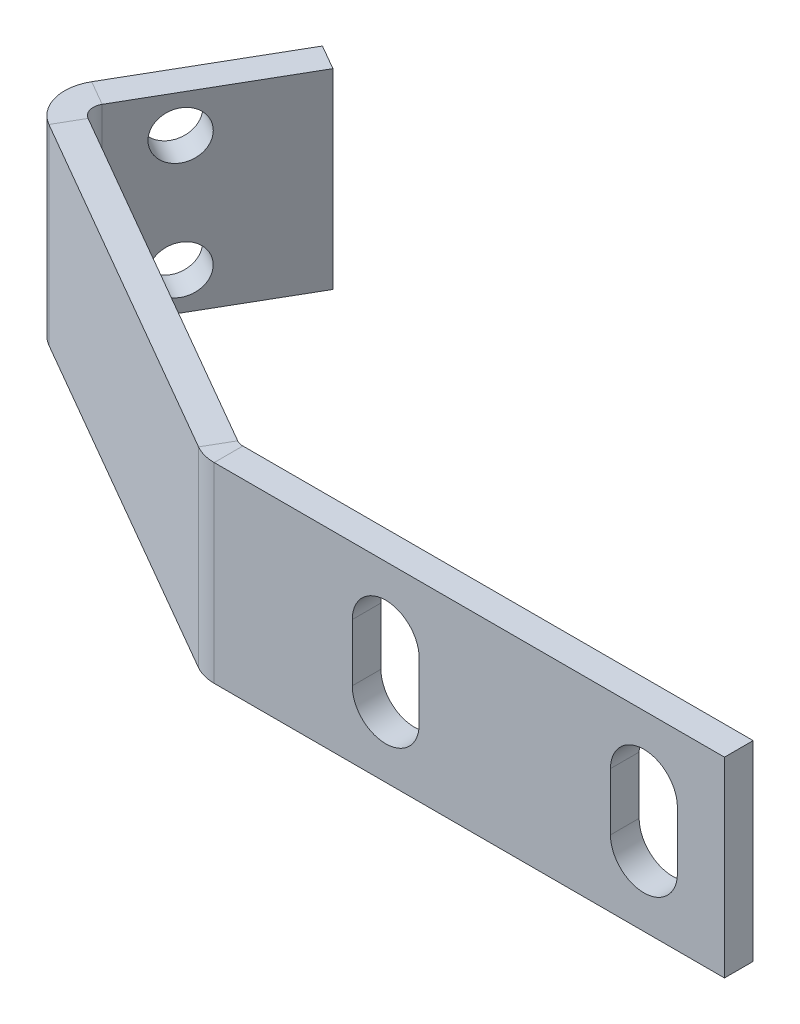
ISO-10303-21;
HEADER;
FILE_DESCRIPTION(('STEP AP214'),'2;1');
FILE_NAME('part.step','',(''),(''),'','','');
FILE_SCHEMA(('AUTOMOTIVE_DESIGN { 1 0 10303 214 1 1 1 1 }'));
ENDSEC;
DATA;
#1=APPLICATION_CONTEXT('core data for automotive mechanical design processes');
#2=APPLICATION_PROTOCOL_DEFINITION('international standard','automotive_design',2000,#1);
#3=PRODUCT_CONTEXT('',#1,'mechanical');
#4=PRODUCT('Part','Part','',(#3));
#5=PRODUCT_RELATED_PRODUCT_CATEGORY('part','',(#4));
#6=PRODUCT_DEFINITION_FORMATION('','',#4);
#7=PRODUCT_DEFINITION_CONTEXT('part definition',#1,'design');
#8=PRODUCT_DEFINITION('design','',#6,#7);
#9=PRODUCT_DEFINITION_SHAPE('','',#8);
#10=(LENGTH_UNIT() NAMED_UNIT(*) SI_UNIT(.MILLI.,.METRE.));
#11=(NAMED_UNIT(*) PLANE_ANGLE_UNIT() SI_UNIT($,.RADIAN.));
#12=(NAMED_UNIT(*) SI_UNIT($,.STERADIAN.) SOLID_ANGLE_UNIT());
#13=UNCERTAINTY_MEASURE_WITH_UNIT(LENGTH_MEASURE(1.E-05),#10,'distance_accuracy_value','');
#14=(GEOMETRIC_REPRESENTATION_CONTEXT(3) GLOBAL_UNCERTAINTY_ASSIGNED_CONTEXT((#13)) GLOBAL_UNIT_ASSIGNED_CONTEXT((#10,
#11,#12)) REPRESENTATION_CONTEXT('',''));
#15=CARTESIAN_POINT('',(0.,0.,0.));
#16=DIRECTION('',(0.,0.,1.));
#17=DIRECTION('',(1.,0.,0.));
#18=AXIS2_PLACEMENT_3D('',#15,#16,#17);
#19=CARTESIAN_POINT('',(0.750616148857739,0.,-2.8695766574746));
#20=DIRECTION('',(0.500000000000001,0.,-0.866025403784438));
#21=DIRECTION('',(-0.866025403784438,0.,-0.500000000000001));
#22=AXIS2_PLACEMENT_3D('',#19,#20,#21);
#23=PLANE('',#22);
#24=DIRECTION('',(-0.866025403784438,0.,-0.500000000000001));
#25=VECTOR('',#24,1.);
#26=CARTESIAN_POINT('',(-25.2301459646754,5.,-17.8695766574746));
#27=LINE('',#26,#25);
#28=CARTESIAN_POINT('',(2.95186387960887,5.,-1.59868568757238));
#29=VERTEX_POINT('',#28);
#30=CARTESIAN_POINT('',(-15.5587441262545,5.,-12.2857902026213));
#31=VERTEX_POINT('',#30);
#32=EDGE_CURVE('E322',#29,#31,#27,.T.);
#33=ORIENTED_EDGE('',*,*,#32,.F.);
#34=DIRECTION('',(0.,-1.,0.));
#35=VECTOR('',#34,1.);
#36=CARTESIAN_POINT('',(2.95186387960887,0.,-1.59868568757238));
#37=LINE('',#36,#35);
#38=CARTESIAN_POINT('',(2.95186387960886,-5.,-1.59868568757238));
#39=VERTEX_POINT('',#38);
#40=EDGE_CURVE('E355',#29,#39,#37,.T.);
#41=ORIENTED_EDGE('',*,*,#40,.T.);
#42=DIRECTION('',(0.866025403784438,0.,0.500000000000001));
#43=VECTOR('',#42,1.);
#44=CARTESIAN_POINT('',(-25.2301459646754,-5.,-17.8695766574746));
#45=LINE('',#44,#43);
#46=CARTESIAN_POINT('',(-15.5587441262545,-5.,-12.2857902026213));
#47=VERTEX_POINT('',#46);
#48=EDGE_CURVE('E316',#47,#39,#45,.T.);
#49=ORIENTED_EDGE('',*,*,#48,.F.);
#50=DIRECTION('',(0.,1.,0.));
#51=VECTOR('',#50,1.);
#52=CARTESIAN_POINT('',(-15.5587441262545,0.,-12.2857902026213));
#53=LINE('',#52,#51);
#54=EDGE_CURVE('E323',#47,#31,#53,.T.);
#55=ORIENTED_EDGE('',*,*,#54,.T.);
#56=EDGE_LOOP('',(#33,#41,#49,#55));
#57=FACE_BOUND('',#56,.T.);
#58=ADVANCED_FACE('F62',(#57),#23,.T.);
#59=CARTESIAN_POINT('',(-25.2301459646754,5.,-17.8695766574746));
#60=DIRECTION('',(0.,1.,0.));
#61=DIRECTION('',(-0.500000000000001,0.,0.866025403784438));
#62=AXIS2_PLACEMENT_3D('',#59,#60,#61);
#63=PLANE('',#62);
#64=DIRECTION('',(-0.866025403784438,0.,-0.500000000000001));
#65=VECTOR('',#64,1.);
#66=CARTESIAN_POINT('',(-25.9801459646754,5.,-16.570538551798));
#67=LINE('',#66,#65);
#68=CARTESIAN_POINT('',(2.20186387960886,5.,-0.299647581895727));
#69=VERTEX_POINT('',#68);
#70=CARTESIAN_POINT('',(-16.3087441262545,5.,-10.9867520969446));
#71=VERTEX_POINT('',#70);
#72=EDGE_CURVE('E317',#69,#71,#67,.T.);
#73=ORIENTED_EDGE('',*,*,#72,.F.);
#74=DIRECTION('',(0.500000000000001,0.,-0.866025403784438));
#75=VECTOR('',#74,1.);
#76=CARTESIAN_POINT('',(2.95186387960886,5.,-1.59868568757238));
#77=LINE('',#76,#75);
#78=EDGE_CURVE('E363',#69,#29,#77,.T.);
#79=ORIENTED_EDGE('',*,*,#78,.T.);
#80=ORIENTED_EDGE('',*,*,#32,.T.);
#81=DIRECTION('',(-0.500000000000001,0.,0.866025403784438));
#82=VECTOR('',#81,1.);
#83=CARTESIAN_POINT('',(-15.5587441262545,5.,-12.2857902026213));
#84=LINE('',#83,#82);
#85=EDGE_CURVE('E318',#31,#71,#84,.T.);
#86=ORIENTED_EDGE('',*,*,#85,.T.);
#87=EDGE_LOOP('',(#73,#79,#80,#86));
#88=FACE_BOUND('',#87,.T.);
#89=ADVANCED_FACE('F417',(#88),#63,.T.);
#90=CARTESIAN_POINT('',(-25.2301459646754,-5.,-17.8695766574746));
#91=DIRECTION('',(0.,-1.,0.));
#92=DIRECTION('',(0.500000000000001,0.,-0.866025403784438));
#93=AXIS2_PLACEMENT_3D('',#90,#91,#92);
#94=PLANE('',#93);
#95=ORIENTED_EDGE('',*,*,#48,.T.);
#96=DIRECTION('',(-0.500000000000001,0.,0.866025403784438));
#97=VECTOR('',#96,1.);
#98=CARTESIAN_POINT('',(2.95186387960886,-5.,-1.59868568757238));
#99=LINE('',#98,#97);
#100=CARTESIAN_POINT('',(2.20186387960886,-5.,-0.299647581895727));
#101=VERTEX_POINT('',#100);
#102=EDGE_CURVE('E368',#39,#101,#99,.T.);
#103=ORIENTED_EDGE('',*,*,#102,.T.);
#104=DIRECTION('',(0.866025403784438,0.,0.500000000000001));
#105=VECTOR('',#104,1.);
#106=CARTESIAN_POINT('',(-25.9801459646754,-5.,-16.570538551798));
#107=LINE('',#106,#105);
#108=CARTESIAN_POINT('',(-16.3087441262545,-5.,-10.9867520969446));
#109=VERTEX_POINT('',#108);
#110=EDGE_CURVE('E321',#109,#101,#107,.T.);
#111=ORIENTED_EDGE('',*,*,#110,.F.);
#112=DIRECTION('',(0.500000000000001,0.,-0.866025403784438));
#113=VECTOR('',#112,1.);
#114=CARTESIAN_POINT('',(-15.5587441262545,-5.,-12.2857902026213));
#115=LINE('',#114,#113);
#116=EDGE_CURVE('E313',#109,#47,#115,.T.);
#117=ORIENTED_EDGE('',*,*,#116,.T.);
#118=EDGE_LOOP('',(#95,#103,#111,#117));
#119=FACE_BOUND('',#118,.T.);
#120=ADVANCED_FACE('F64',(#119),#94,.T.);
#121=CARTESIAN_POINT('',(-27.7111829992122,0.,4.28965136121627));
#122=DIRECTION('',(0.866025403784436,0.,0.500000000000004));
#123=DIRECTION('',(0.500000000000004,0.,-0.866025403784436));
#124=AXIS2_PLACEMENT_3D('',#121,#122,#123);
#125=PLANE('',#124);
#126=CARTESIAN_POINT('',(-15.6273965443588,-3.04204544847123,-16.6400807264022));
#127=DIRECTION('',(-0.866025403784436,0.,-0.500000000000004));
#128=DIRECTION('',(-0.500000000000004,0.,0.866025403784436));
#129=AXIS2_PLACEMENT_3D('',#126,#127,#128);
#130=CIRCLE('',#129,1.25);
#131=CARTESIAN_POINT('',(-16.2523965443588,-3.04204544847123,-15.5575489716716));
#132=VERTEX_POINT('',#131);
#133=EDGE_CURVE('E251',#132,#132,#130,.T.);
#134=ORIENTED_EDGE('',*,*,#133,.F.);
#135=EDGE_LOOP('',(#134));
#136=FACE_BOUND('',#135,.T.);
#137=CARTESIAN_POINT('',(-15.6260131484009,3.04204544847139,-16.6424768384883));
#138=DIRECTION('',(-0.866025403784436,0.,-0.500000000000004));
#139=DIRECTION('',(-0.500000000000004,0.,0.866025403784436));
#140=AXIS2_PLACEMENT_3D('',#137,#138,#139);
#141=CIRCLE('',#140,1.25);
#142=CARTESIAN_POINT('',(-16.2510131484009,3.04204544847139,-15.5599450837577));
#143=VERTEX_POINT('',#142);
#144=EDGE_CURVE('E230',#143,#143,#141,.T.);
#145=ORIENTED_EDGE('',*,*,#144,.F.);
#146=EDGE_LOOP('',(#145));
#147=FACE_BOUND('',#146,.T.);
#148=DIRECTION('',(-0.500000000000004,0.,0.866025403784436));
#149=VECTOR('',#148,1.);
#150=CARTESIAN_POINT('',(-12.7111829992121,-5.,-21.6911107523168));
#151=LINE('',#150,#149);
#152=CARTESIAN_POINT('',(-12.7111829992121,-5.,-21.6911107523168));
#153=VERTEX_POINT('',#152);
#154=CARTESIAN_POINT('',(-17.1273965443588,-5.,-14.0420045150489));
#155=VERTEX_POINT('',#154);
#156=EDGE_CURVE('E336',#153,#155,#151,.T.);
#157=ORIENTED_EDGE('',*,*,#156,.T.);
#158=DIRECTION('',(0.,1.,0.));
#159=VECTOR('',#158,1.);
#160=CARTESIAN_POINT('',(-17.1273965443588,0.,-14.0420045150489));
#161=LINE('',#160,#159);
#162=CARTESIAN_POINT('',(-17.1273965443588,5.,-14.0420045150489));
#163=VERTEX_POINT('',#162);
#164=EDGE_CURVE('E349',#155,#163,#161,.T.);
#165=ORIENTED_EDGE('',*,*,#164,.T.);
#166=DIRECTION('',(0.500000000000004,0.,-0.866025403784436));
#167=VECTOR('',#166,1.);
#168=CARTESIAN_POINT('',(-12.7111829992121,5.,-21.6911107523168));
#169=LINE('',#168,#167);
#170=CARTESIAN_POINT('',(-12.7111829992121,5.,-21.6911107523168));
#171=VERTEX_POINT('',#170);
#172=EDGE_CURVE('E337',#163,#171,#169,.T.);
#173=ORIENTED_EDGE('',*,*,#172,.T.);
#174=DIRECTION('',(0.,-1.,0.));
#175=VECTOR('',#174,1.);
#176=CARTESIAN_POINT('',(-12.7111829992121,-5.,-21.6911107523168));
#177=LINE('',#176,#175);
#178=EDGE_CURVE('E333',#171,#153,#177,.T.);
#179=ORIENTED_EDGE('',*,*,#178,.T.);
#180=EDGE_LOOP('',(#157,#165,#173,#179));
#181=FACE_BOUND('',#180,.T.);
#182=ADVANCED_FACE('F510',(#136,#147,#181),#125,.F.);
#183=CARTESIAN_POINT('',(-11.4121448935355,-5.,-20.9411107523168));
#184=DIRECTION('',(0.,-1.,0.));
#185=DIRECTION('',(0.866025403784436,0.,0.500000000000004));
#186=AXIS2_PLACEMENT_3D('',#183,#184,#185);
#187=PLANE('',#186);
#188=DIRECTION('',(0.866025403784436,0.,0.500000000000004));
#189=VECTOR('',#188,1.);
#190=CARTESIAN_POINT('',(-15.8283584386822,-5.,-13.2920045150489));
#191=LINE('',#190,#189);
#192=CARTESIAN_POINT('',(-15.8283584386822,-5.,-13.2920045150489));
#193=VERTEX_POINT('',#192);
#194=EDGE_CURVE('E352',#155,#193,#191,.T.);
#195=ORIENTED_EDGE('',*,*,#194,.F.);
#196=ORIENTED_EDGE('',*,*,#156,.F.);
#197=DIRECTION('',(-0.866025403784436,0.,-0.500000000000004));
#198=VECTOR('',#197,1.);
#199=CARTESIAN_POINT('',(-11.4121448935355,-5.,-20.9411107523168));
#200=LINE('',#199,#198);
#201=CARTESIAN_POINT('',(-11.4121448935355,-5.,-20.9411107523168));
#202=VERTEX_POINT('',#201);
#203=EDGE_CURVE('E338',#202,#153,#200,.T.);
#204=ORIENTED_EDGE('',*,*,#203,.F.);
#205=DIRECTION('',(-0.500000000000004,0.,0.866025403784436));
#206=VECTOR('',#205,1.);
#207=CARTESIAN_POINT('',(-11.4121448935355,-5.,-20.9411107523168));
#208=LINE('',#207,#206);
#209=EDGE_CURVE('E331',#202,#193,#208,.T.);
#210=ORIENTED_EDGE('',*,*,#209,.T.);
#211=EDGE_LOOP('',(#195,#196,#204,#210));
#212=FACE_BOUND('',#211,.T.);
#213=ADVANCED_FACE('F427',(#212),#187,.T.);
#214=CARTESIAN_POINT('',(-11.4121448935355,-5.,-20.9411107523168));
#215=DIRECTION('',(0.500000000000004,0.,-0.866025403784436));
#216=DIRECTION('',(-0.866025403784436,0.,-0.500000000000004));
#217=AXIS2_PLACEMENT_3D('',#214,#215,#216);
#218=PLANE('',#217);
#219=ORIENTED_EDGE('',*,*,#178,.F.);
#220=DIRECTION('',(-0.866025403784436,0.,-0.500000000000004));
#221=VECTOR('',#220,1.);
#222=CARTESIAN_POINT('',(-11.4121448935355,5.,-20.9411107523168));
#223=LINE('',#222,#221);
#224=CARTESIAN_POINT('',(-11.4121448935355,5.,-20.9411107523168));
#225=VERTEX_POINT('',#224);
#226=EDGE_CURVE('E341',#225,#171,#223,.T.);
#227=ORIENTED_EDGE('',*,*,#226,.F.);
#228=DIRECTION('',(0.,-1.,0.));
#229=VECTOR('',#228,1.);
#230=CARTESIAN_POINT('',(-11.4121448935355,-5.,-20.9411107523168));
#231=LINE('',#230,#229);
#232=EDGE_CURVE('E328',#225,#202,#231,.T.);
#233=ORIENTED_EDGE('',*,*,#232,.T.);
#234=ORIENTED_EDGE('',*,*,#203,.T.);
#235=EDGE_LOOP('',(#219,#227,#233,#234));
#236=FACE_BOUND('',#235,.T.);
#237=ADVANCED_FACE('F504',(#236),#218,.T.);
#238=CARTESIAN_POINT('',(-11.4121448935355,5.,-20.9411107523168));
#239=DIRECTION('',(0.,1.,0.));
#240=DIRECTION('',(-0.866025403784436,0.,-0.500000000000004));
#241=AXIS2_PLACEMENT_3D('',#238,#239,#240);
#242=PLANE('',#241);
#243=DIRECTION('',(-0.866025403784436,0.,-0.500000000000004));
#244=VECTOR('',#243,1.);
#245=CARTESIAN_POINT('',(-15.8283584386822,5.,-13.2920045150489));
#246=LINE('',#245,#244);
#247=CARTESIAN_POINT('',(-15.8283584386822,5.,-13.2920045150489));
#248=VERTEX_POINT('',#247);
#249=EDGE_CURVE('E346',#248,#163,#246,.T.);
#250=ORIENTED_EDGE('',*,*,#249,.F.);
#251=DIRECTION('',(0.500000000000004,0.,-0.866025403784436));
#252=VECTOR('',#251,1.);
#253=CARTESIAN_POINT('',(-11.4121448935355,5.,-20.9411107523168));
#254=LINE('',#253,#252);
#255=EDGE_CURVE('E332',#248,#225,#254,.T.);
#256=ORIENTED_EDGE('',*,*,#255,.T.);
#257=ORIENTED_EDGE('',*,*,#226,.T.);
#258=ORIENTED_EDGE('',*,*,#172,.F.);
#259=EDGE_LOOP('',(#250,#256,#257,#258));
#260=FACE_BOUND('',#259,.T.);
#261=ADVANCED_FACE('F441',(#260),#242,.T.);
#262=CARTESIAN_POINT('',(-26.4121448935356,0.,5.03965136121628));
#263=DIRECTION('',(0.866025403784436,0.,0.500000000000004));
#264=DIRECTION('',(0.500000000000004,0.,-0.866025403784436));
#265=AXIS2_PLACEMENT_3D('',#262,#263,#264);
#266=PLANE('',#265);
#267=CARTESIAN_POINT('',(-14.3283584386822,-3.04204544847123,-15.8900807264022));
#268=DIRECTION('',(0.866025403784436,0.,0.500000000000004));
#269=DIRECTION('',(0.500000000000004,0.,-0.866025403784436));
#270=AXIS2_PLACEMENT_3D('',#267,#268,#269);
#271=CIRCLE('',#270,1.25);
#272=CARTESIAN_POINT('',(-13.7033584386822,-3.04204544847123,-16.9726124811327));
#273=VERTEX_POINT('',#272);
#274=EDGE_CURVE('E267',#273,#273,#271,.T.);
#275=ORIENTED_EDGE('',*,*,#274,.F.);
#276=EDGE_LOOP('',(#275));
#277=FACE_BOUND('',#276,.T.);
#278=CARTESIAN_POINT('',(-14.3269750427243,3.04204544847139,-15.8924768384882));
#279=DIRECTION('',(0.866025403784436,0.,0.500000000000004));
#280=DIRECTION('',(0.500000000000004,0.,-0.866025403784436));
#281=AXIS2_PLACEMENT_3D('',#278,#279,#280);
#282=CIRCLE('',#281,1.25);
#283=CARTESIAN_POINT('',(-13.7019750427243,3.04204544847139,-16.9750085932188));
#284=VERTEX_POINT('',#283);
#285=EDGE_CURVE('E254',#284,#284,#282,.T.);
#286=ORIENTED_EDGE('',*,*,#285,.F.);
#287=EDGE_LOOP('',(#286));
#288=FACE_BOUND('',#287,.T.);
#289=DIRECTION('',(0.,1.,0.));
#290=VECTOR('',#289,1.);
#291=CARTESIAN_POINT('',(-15.8283584386822,0.,-13.2920045150489));
#292=LINE('',#291,#290);
#293=EDGE_CURVE('E340',#193,#248,#292,.T.);
#294=ORIENTED_EDGE('',*,*,#293,.F.);
#295=ORIENTED_EDGE('',*,*,#209,.F.);
#296=ORIENTED_EDGE('',*,*,#232,.F.);
#297=ORIENTED_EDGE('',*,*,#255,.F.);
#298=EDGE_LOOP('',(#294,#295,#296,#297));
#299=FACE_BOUND('',#298,.T.);
#300=ADVANCED_FACE('F432',(#277,#288,#299),#266,.T.);
#301=CARTESIAN_POINT('',(0.000616148857737493,0.,-1.57053855179794));
#302=DIRECTION('',(0.500000000000001,0.,-0.866025403784438));
#303=DIRECTION('',(-0.866025403784438,0.,-0.500000000000001));
#304=AXIS2_PLACEMENT_3D('',#301,#302,#303);
#305=PLANE('',#304);
#306=DIRECTION('',(0.,-1.,0.));
#307=VECTOR('',#306,1.);
#308=CARTESIAN_POINT('',(2.20186387960887,0.,-0.299647581895725));
#309=LINE('',#308,#307);
#310=EDGE_CURVE('E366',#69,#101,#309,.T.);
#311=ORIENTED_EDGE('',*,*,#310,.F.);
#312=ORIENTED_EDGE('',*,*,#72,.T.);
#313=DIRECTION('',(0.,1.,0.));
#314=VECTOR('',#313,1.);
#315=CARTESIAN_POINT('',(-16.3087441262545,0.,-10.9867520969446));
#316=LINE('',#315,#314);
#317=EDGE_CURVE('E308',#109,#71,#316,.T.);
#318=ORIENTED_EDGE('',*,*,#317,.F.);
#319=ORIENTED_EDGE('',*,*,#110,.T.);
#320=EDGE_LOOP('',(#311,#312,#318,#319));
#321=FACE_BOUND('',#320,.T.);
#322=ADVANCED_FACE('F429',(#321),#305,.F.);
#323=CARTESIAN_POINT('',(-15.1904441262545,-5.,-12.9237045150489));
#324=DIRECTION('',(0.,1.,0.));
#325=DIRECTION('',(-0.500000000000001,0.,0.866025403784438));
#326=AXIS2_PLACEMENT_3D('',#323,#324,#325);
#327=PLANE('',#326);
#328=ORIENTED_EDGE('',*,*,#116,.F.);
#329=CARTESIAN_POINT('',(-15.1904441262545,-5.,-12.9237045150489));
#330=DIRECTION('',(0.,1.,0.));
#331=DIRECTION('',(-0.500000000000001,0.,0.866025403784438));
#332=AXIS2_PLACEMENT_3D('',#329,#330,#331);
#333=CIRCLE('',#332,2.2366);
#334=EDGE_CURVE('E273',#109,#155,#333,.F.);
#335=ORIENTED_EDGE('',*,*,#334,.T.);
#336=ORIENTED_EDGE('',*,*,#194,.T.);
#337=CARTESIAN_POINT('',(-15.1904441262545,-5.,-12.9237045150489));
#338=DIRECTION('',(0.,-1.,0.));
#339=DIRECTION('',(-0.500000000000001,0.,0.866025403784438));
#340=AXIS2_PLACEMENT_3D('',#337,#338,#339);
#341=CIRCLE('',#340,0.7366);
#342=EDGE_CURVE('E301',#47,#193,#341,.T.);
#343=ORIENTED_EDGE('',*,*,#342,.F.);
#344=EDGE_LOOP('',(#328,#335,#336,#343));
#345=FACE_BOUND('',#344,.T.);
#346=ADVANCED_FACE('F431',(#345),#327,.F.);
#347=CARTESIAN_POINT('',(-15.1904441262545,5.,-12.9237045150489));
#348=DIRECTION('',(0.,-1.,0.));
#349=DIRECTION('',(0.500000000000001,0.,-0.866025403784438));
#350=AXIS2_PLACEMENT_3D('',#347,#348,#349);
#351=PLANE('',#350);
#352=CARTESIAN_POINT('',(-15.1904441262545,5.,-12.9237045150489));
#353=DIRECTION('',(0.,1.,0.));
#354=DIRECTION('',(-0.500000000000001,0.,0.866025403784438));
#355=AXIS2_PLACEMENT_3D('',#352,#353,#354);
#356=CIRCLE('',#355,2.2366);
#357=EDGE_CURVE('E305',#163,#71,#356,.T.);
#358=ORIENTED_EDGE('',*,*,#357,.T.);
#359=ORIENTED_EDGE('',*,*,#85,.F.);
#360=CARTESIAN_POINT('',(-15.1904441262545,5.,-12.9237045150489));
#361=DIRECTION('',(0.,1.,0.));
#362=DIRECTION('',(0.500000000000001,0.,-0.866025403784438));
#363=AXIS2_PLACEMENT_3D('',#360,#361,#362);
#364=CIRCLE('',#363,0.7366);
#365=EDGE_CURVE('E304',#248,#31,#364,.T.);
#366=ORIENTED_EDGE('',*,*,#365,.F.);
#367=ORIENTED_EDGE('',*,*,#249,.T.);
#368=EDGE_LOOP('',(#358,#359,#366,#367));
#369=FACE_BOUND('',#368,.T.);
#370=ADVANCED_FACE('F438',(#369),#351,.F.);
#371=CARTESIAN_POINT('',(-15.1904441262545,-10.3780010598344,-12.9237045150489));
#372=DIRECTION('',(0.,1.,0.));
#373=DIRECTION('',(-0.500000000000001,0.,0.866025403784438));
#374=AXIS2_PLACEMENT_3D('',#371,#372,#373);
#375=CYLINDRICAL_SURFACE('',#374,0.7366);
#376=ORIENTED_EDGE('',*,*,#293,.T.);
#377=ORIENTED_EDGE('',*,*,#365,.T.);
#378=ORIENTED_EDGE('',*,*,#54,.F.);
#379=ORIENTED_EDGE('',*,*,#342,.T.);
#380=EDGE_LOOP('',(#376,#377,#378,#379));
#381=FACE_BOUND('',#380,.T.);
#382=ADVANCED_FACE('F486',(#381),#375,.F.);
#383=CARTESIAN_POINT('',(-15.1904441262545,-10.3780010598344,-12.9237045150489));
#384=DIRECTION('',(0.,1.,0.));
#385=DIRECTION('',(-0.500000000000001,0.,0.866025403784438));
#386=AXIS2_PLACEMENT_3D('',#383,#384,#385);
#387=CYLINDRICAL_SURFACE('',#386,2.2366);
#388=ORIENTED_EDGE('',*,*,#164,.F.);
#389=ORIENTED_EDGE('',*,*,#334,.F.);
#390=ORIENTED_EDGE('',*,*,#317,.T.);
#391=ORIENTED_EDGE('',*,*,#357,.F.);
#392=EDGE_LOOP('',(#388,#389,#390,#391));
#393=FACE_BOUND('',#392,.T.);
#394=ADVANCED_FACE('F479',(#393),#387,.T.);
#395=CARTESIAN_POINT('',(30.,-5.,-1.5));
#396=DIRECTION('',(1.,0.,0.));
#397=DIRECTION('',(0.,0.,-1.));
#398=AXIS2_PLACEMENT_3D('',#395,#396,#397);
#399=PLANE('',#398);
#400=DIRECTION('',(0.,1.,0.));
#401=VECTOR('',#400,1.);
#402=CARTESIAN_POINT('',(30.,-5.,0.));
#403=LINE('',#402,#401);
#404=CARTESIAN_POINT('',(30.,-5.,0.));
#405=VERTEX_POINT('',#404);
#406=CARTESIAN_POINT('',(30.,5.,0.));
#407=VERTEX_POINT('',#406);
#408=EDGE_CURVE('E276',#405,#407,#403,.T.);
#409=ORIENTED_EDGE('',*,*,#408,.F.);
#410=DIRECTION('',(0.,0.,1.));
#411=VECTOR('',#410,1.);
#412=CARTESIAN_POINT('',(30.,-5.,-1.5));
#413=LINE('',#412,#411);
#414=CARTESIAN_POINT('',(30.,-5.,-1.5));
#415=VERTEX_POINT('',#414);
#416=EDGE_CURVE('E270',#415,#405,#413,.T.);
#417=ORIENTED_EDGE('',*,*,#416,.F.);
#418=DIRECTION('',(0.,1.,0.));
#419=VECTOR('',#418,1.);
#420=CARTESIAN_POINT('',(30.,-5.,-1.5));
#421=LINE('',#420,#419);
#422=CARTESIAN_POINT('',(30.,5.,-1.5));
#423=VERTEX_POINT('',#422);
#424=EDGE_CURVE('E290',#415,#423,#421,.T.);
#425=ORIENTED_EDGE('',*,*,#424,.T.);
#426=DIRECTION('',(0.,0.,1.));
#427=VECTOR('',#426,1.);
#428=CARTESIAN_POINT('',(30.,5.,-1.5));
#429=LINE('',#428,#427);
#430=EDGE_CURVE('E288',#423,#407,#429,.T.);
#431=ORIENTED_EDGE('',*,*,#430,.T.);
#432=EDGE_LOOP('',(#409,#417,#425,#431));
#433=FACE_BOUND('',#432,.T.);
#434=ADVANCED_FACE('F477',(#433),#399,.T.);
#435=CARTESIAN_POINT('',(0.,0.,-1.5));
#436=DIRECTION('',(0.,0.,-1.));
#437=DIRECTION('',(-1.,0.,0.));
#438=AXIS2_PLACEMENT_3D('',#435,#436,#437);
#439=PLANE('',#438);
#440=CARTESIAN_POINT('',(25.7894427450082,-1.5,-1.5));
#441=DIRECTION('',(0.,0.,-1.));
#442=DIRECTION('',(-1.,0.,0.));
#443=AXIS2_PLACEMENT_3D('',#440,#441,#442);
#444=CIRCLE('',#443,1.75);
#445=CARTESIAN_POINT('',(27.5394427450082,-1.5,-1.5));
#446=VERTEX_POINT('',#445);
#447=CARTESIAN_POINT('',(24.0394427450082,-1.5,-1.5));
#448=VERTEX_POINT('',#447);
#449=EDGE_CURVE('E77',#446,#448,#444,.T.);
#450=ORIENTED_EDGE('',*,*,#449,.F.);
#451=DIRECTION('',(0.,-1.,0.));
#452=VECTOR('',#451,1.);
#453=CARTESIAN_POINT('',(27.5394427450082,-1.5,-1.5));
#454=LINE('',#453,#452);
#455=CARTESIAN_POINT('',(27.5394427450082,1.5,-1.5));
#456=VERTEX_POINT('',#455);
#457=EDGE_CURVE('E223',#456,#446,#454,.T.);
#458=ORIENTED_EDGE('',*,*,#457,.F.);
#459=CARTESIAN_POINT('',(25.7894427450082,1.5,-1.5));
#460=DIRECTION('',(0.,0.,-1.));
#461=DIRECTION('',(-1.,0.,0.));
#462=AXIS2_PLACEMENT_3D('',#459,#460,#461);
#463=CIRCLE('',#462,1.75);
#464=CARTESIAN_POINT('',(24.0394427450082,1.5,-1.5));
#465=VERTEX_POINT('',#464);
#466=EDGE_CURVE('E206',#465,#456,#463,.T.);
#467=ORIENTED_EDGE('',*,*,#466,.F.);
#468=DIRECTION('',(0.,1.,0.));
#469=VECTOR('',#468,1.);
#470=CARTESIAN_POINT('',(24.0394427450082,-1.5,-1.5));
#471=LINE('',#470,#469);
#472=EDGE_CURVE('E216',#448,#465,#471,.T.);
#473=ORIENTED_EDGE('',*,*,#472,.F.);
#474=EDGE_LOOP('',(#450,#458,#467,#473));
#475=FACE_BOUND('',#474,.T.);
#476=CARTESIAN_POINT('',(12.2894427450082,-1.5,-1.5));
#477=DIRECTION('',(0.,0.,-1.));
#478=DIRECTION('',(-1.,0.,0.));
#479=AXIS2_PLACEMENT_3D('',#476,#477,#478);
#480=CIRCLE('',#479,1.75);
#481=CARTESIAN_POINT('',(14.0394427450082,-1.5,-1.5));
#482=VERTEX_POINT('',#481);
#483=CARTESIAN_POINT('',(10.5394427450082,-1.5,-1.5));
#484=VERTEX_POINT('',#483);
#485=EDGE_CURVE('E85',#482,#484,#480,.T.);
#486=ORIENTED_EDGE('',*,*,#485,.F.);
#487=DIRECTION('',(0.,-1.,0.));
#488=VECTOR('',#487,1.);
#489=CARTESIAN_POINT('',(14.0394427450082,-1.5,-1.5));
#490=LINE('',#489,#488);
#491=CARTESIAN_POINT('',(14.0394427450082,1.5,-1.5));
#492=VERTEX_POINT('',#491);
#493=EDGE_CURVE('E240',#492,#482,#490,.T.);
#494=ORIENTED_EDGE('',*,*,#493,.F.);
#495=CARTESIAN_POINT('',(12.2894427450082,1.5,-1.5));
#496=DIRECTION('',(0.,0.,-1.));
#497=DIRECTION('',(-1.,0.,0.));
#498=AXIS2_PLACEMENT_3D('',#495,#496,#497);
#499=CIRCLE('',#498,1.75);
#500=CARTESIAN_POINT('',(10.5394427450082,1.5,-1.5));
#501=VERTEX_POINT('',#500);
#502=EDGE_CURVE('E237',#501,#492,#499,.T.);
#503=ORIENTED_EDGE('',*,*,#502,.F.);
#504=DIRECTION('',(0.,1.,0.));
#505=VECTOR('',#504,1.);
#506=CARTESIAN_POINT('',(10.5394427450082,-1.5,-1.5));
#507=LINE('',#506,#505);
#508=EDGE_CURVE('E234',#484,#501,#507,.T.);
#509=ORIENTED_EDGE('',*,*,#508,.F.);
#510=EDGE_LOOP('',(#486,#494,#503,#509));
#511=FACE_BOUND('',#510,.T.);
#512=DIRECTION('',(0.,-1.,0.));
#513=VECTOR('',#512,1.);
#514=CARTESIAN_POINT('',(3.32016387960887,0.,-1.5));
#515=LINE('',#514,#513);
#516=CARTESIAN_POINT('',(3.32016387960887,5.,-1.5));
#517=VERTEX_POINT('',#516);
#518=CARTESIAN_POINT('',(3.32016387960887,-5.,-1.5));
#519=VERTEX_POINT('',#518);
#520=EDGE_CURVE('E263',#517,#519,#515,.T.);
#521=ORIENTED_EDGE('',*,*,#520,.F.);
#522=DIRECTION('',(-1.,0.,0.));
#523=VECTOR('',#522,1.);
#524=CARTESIAN_POINT('',(-30.,5.,-1.5));
#525=LINE('',#524,#523);
#526=EDGE_CURVE('E286',#423,#517,#525,.T.);
#527=ORIENTED_EDGE('',*,*,#526,.F.);
#528=ORIENTED_EDGE('',*,*,#424,.F.);
#529=DIRECTION('',(1.,0.,0.));
#530=VECTOR('',#529,1.);
#531=CARTESIAN_POINT('',(-30.,-5.,-1.5));
#532=LINE('',#531,#530);
#533=EDGE_CURVE('E274',#519,#415,#532,.T.);
#534=ORIENTED_EDGE('',*,*,#533,.F.);
#535=EDGE_LOOP('',(#521,#527,#528,#534));
#536=FACE_BOUND('',#535,.T.);
#537=ADVANCED_FACE('F220',(#475,#511,#536),#439,.T.);
#538=CARTESIAN_POINT('',(-30.,5.,-1.5));
#539=DIRECTION('',(0.,1.,0.));
#540=DIRECTION('',(0.,0.,1.));
#541=AXIS2_PLACEMENT_3D('',#538,#539,#540);
#542=PLANE('',#541);
#543=DIRECTION('',(0.,0.,-1.));
#544=VECTOR('',#543,1.);
#545=CARTESIAN_POINT('',(3.32016387960887,5.,-1.5));
#546=LINE('',#545,#544);
#547=CARTESIAN_POINT('',(3.32016387960887,5.,0.));
#548=VERTEX_POINT('',#547);
#549=EDGE_CURVE('E293',#548,#517,#546,.T.);
#550=ORIENTED_EDGE('',*,*,#549,.F.);
#551=DIRECTION('',(-1.,0.,0.));
#552=VECTOR('',#551,1.);
#553=CARTESIAN_POINT('',(-30.,5.,0.));
#554=LINE('',#553,#552);
#555=EDGE_CURVE('E284',#407,#548,#554,.T.);
#556=ORIENTED_EDGE('',*,*,#555,.F.);
#557=ORIENTED_EDGE('',*,*,#430,.F.);
#558=ORIENTED_EDGE('',*,*,#526,.T.);
#559=EDGE_LOOP('',(#550,#556,#557,#558));
#560=FACE_BOUND('',#559,.T.);
#561=ADVANCED_FACE('F473',(#560),#542,.T.);
#562=CARTESIAN_POINT('',(0.,0.,0.));
#563=DIRECTION('',(0.,0.,-1.));
#564=DIRECTION('',(-1.,0.,0.));
#565=AXIS2_PLACEMENT_3D('',#562,#563,#564);
#566=PLANE('',#565);
#567=DIRECTION('',(0.,-1.,0.));
#568=VECTOR('',#567,1.);
#569=CARTESIAN_POINT('',(27.5394427450082,0.,0.));
#570=LINE('',#569,#568);
#571=CARTESIAN_POINT('',(27.5394427450082,1.5,0.));
#572=VERTEX_POINT('',#571);
#573=CARTESIAN_POINT('',(27.5394427450082,-1.5,0.));
#574=VERTEX_POINT('',#573);
#575=EDGE_CURVE('E70',#572,#574,#570,.T.);
#576=ORIENTED_EDGE('',*,*,#575,.T.);
#577=CARTESIAN_POINT('',(25.7894427450082,-1.5,0.));
#578=DIRECTION('',(0.,0.,-1.));
#579=DIRECTION('',(-1.,0.,0.));
#580=AXIS2_PLACEMENT_3D('',#577,#578,#579);
#581=CIRCLE('',#580,1.75);
#582=CARTESIAN_POINT('',(24.0394427450082,-1.5,0.));
#583=VERTEX_POINT('',#582);
#584=EDGE_CURVE('E14',#574,#583,#581,.T.);
#585=ORIENTED_EDGE('',*,*,#584,.T.);
#586=DIRECTION('',(0.,1.,0.));
#587=VECTOR('',#586,1.);
#588=CARTESIAN_POINT('',(24.0394427450082,0.,0.));
#589=LINE('',#588,#587);
#590=CARTESIAN_POINT('',(24.0394427450082,1.5,0.));
#591=VERTEX_POINT('',#590);
#592=EDGE_CURVE('E393',#583,#591,#589,.T.);
#593=ORIENTED_EDGE('',*,*,#592,.T.);
#594=CARTESIAN_POINT('',(25.7894427450082,1.5,0.));
#595=DIRECTION('',(0.,0.,-1.));
#596=DIRECTION('',(-1.,0.,0.));
#597=AXIS2_PLACEMENT_3D('',#594,#595,#596);
#598=CIRCLE('',#597,1.75);
#599=EDGE_CURVE('E209',#591,#572,#598,.T.);
#600=ORIENTED_EDGE('',*,*,#599,.T.);
#601=EDGE_LOOP('',(#576,#585,#593,#600));
#602=FACE_BOUND('',#601,.T.);
#603=DIRECTION('',(0.,-1.,0.));
#604=VECTOR('',#603,1.);
#605=CARTESIAN_POINT('',(14.0394427450082,0.,0.));
#606=LINE('',#605,#604);
#607=CARTESIAN_POINT('',(14.0394427450082,1.5,0.));
#608=VERTEX_POINT('',#607);
#609=CARTESIAN_POINT('',(14.0394427450082,-1.5,0.));
#610=VERTEX_POINT('',#609);
#611=EDGE_CURVE('E387',#608,#610,#606,.T.);
#612=ORIENTED_EDGE('',*,*,#611,.T.);
#613=CARTESIAN_POINT('',(12.2894427450082,-1.5,0.));
#614=DIRECTION('',(0.,0.,-1.));
#615=DIRECTION('',(-1.,0.,0.));
#616=AXIS2_PLACEMENT_3D('',#613,#614,#615);
#617=CIRCLE('',#616,1.75);
#618=CARTESIAN_POINT('',(10.5394427450082,-1.5,0.));
#619=VERTEX_POINT('',#618);
#620=EDGE_CURVE('E390',#610,#619,#617,.T.);
#621=ORIENTED_EDGE('',*,*,#620,.T.);
#622=DIRECTION('',(0.,1.,0.));
#623=VECTOR('',#622,1.);
#624=CARTESIAN_POINT('',(10.5394427450082,0.,0.));
#625=LINE('',#624,#623);
#626=CARTESIAN_POINT('',(10.5394427450082,1.5,0.));
#627=VERTEX_POINT('',#626);
#628=EDGE_CURVE('E371',#619,#627,#625,.T.);
#629=ORIENTED_EDGE('',*,*,#628,.T.);
#630=CARTESIAN_POINT('',(12.2894427450082,1.5,0.));
#631=DIRECTION('',(0.,0.,-1.));
#632=DIRECTION('',(-1.,0.,0.));
#633=AXIS2_PLACEMENT_3D('',#630,#631,#632);
#634=CIRCLE('',#633,1.75);
#635=EDGE_CURVE('E384',#627,#608,#634,.T.);
#636=ORIENTED_EDGE('',*,*,#635,.T.);
#637=EDGE_LOOP('',(#612,#621,#629,#636));
#638=FACE_BOUND('',#637,.T.);
#639=ORIENTED_EDGE('',*,*,#555,.T.);
#640=DIRECTION('',(0.,-1.,0.));
#641=VECTOR('',#640,1.);
#642=CARTESIAN_POINT('',(3.32016387960887,0.,0.));
#643=LINE('',#642,#641);
#644=CARTESIAN_POINT('',(3.32016387960887,-5.,0.));
#645=VERTEX_POINT('',#644);
#646=EDGE_CURVE('E281',#548,#645,#643,.T.);
#647=ORIENTED_EDGE('',*,*,#646,.T.);
#648=DIRECTION('',(1.,0.,0.));
#649=VECTOR('',#648,1.);
#650=CARTESIAN_POINT('',(-30.,-5.,0.));
#651=LINE('',#650,#649);
#652=EDGE_CURVE('E279',#645,#405,#651,.T.);
#653=ORIENTED_EDGE('',*,*,#652,.T.);
#654=ORIENTED_EDGE('',*,*,#408,.T.);
#655=EDGE_LOOP('',(#639,#647,#653,#654));
#656=FACE_BOUND('',#655,.T.);
#657=ADVANCED_FACE('F397',(#602,#638,#656),#566,.F.);
#658=CARTESIAN_POINT('',(-30.,-5.,-1.5));
#659=DIRECTION('',(0.,-1.,0.));
#660=DIRECTION('',(0.,0.,-1.));
#661=AXIS2_PLACEMENT_3D('',#658,#659,#660);
#662=PLANE('',#661);
#663=DIRECTION('',(0.,0.,1.));
#664=VECTOR('',#663,1.);
#665=CARTESIAN_POINT('',(3.32016387960887,-5.,-1.5));
#666=LINE('',#665,#664);
#667=EDGE_CURVE('E296',#519,#645,#666,.T.);
#668=ORIENTED_EDGE('',*,*,#667,.F.);
#669=ORIENTED_EDGE('',*,*,#533,.T.);
#670=ORIENTED_EDGE('',*,*,#416,.T.);
#671=ORIENTED_EDGE('',*,*,#652,.F.);
#672=EDGE_LOOP('',(#668,#669,#670,#671));
#673=FACE_BOUND('',#672,.T.);
#674=ADVANCED_FACE('F459',(#673),#662,.T.);
#675=CARTESIAN_POINT('',(3.32016387960887,5.,-2.2366));
#676=DIRECTION('',(0.,-1.,0.));
#677=DIRECTION('',(0.,0.,-1.));
#678=AXIS2_PLACEMENT_3D('',#675,#676,#677);
#679=PLANE('',#678);
#680=ORIENTED_EDGE('',*,*,#78,.F.);
#681=CARTESIAN_POINT('',(3.32016387960887,5.,-2.2366));
#682=DIRECTION('',(0.,1.,0.));
#683=DIRECTION('',(0.,0.,1.));
#684=AXIS2_PLACEMENT_3D('',#681,#682,#683);
#685=CIRCLE('',#684,2.2366);
#686=EDGE_CURVE('E264',#69,#548,#685,.T.);
#687=ORIENTED_EDGE('',*,*,#686,.T.);
#688=ORIENTED_EDGE('',*,*,#549,.T.);
#689=CARTESIAN_POINT('',(3.32016387960887,5.,-2.2366));
#690=DIRECTION('',(0.,1.,0.));
#691=DIRECTION('',(0.,0.,-1.));
#692=AXIS2_PLACEMENT_3D('',#689,#690,#691);
#693=CIRCLE('',#692,0.7366);
#694=EDGE_CURVE('E257',#29,#517,#693,.T.);
#695=ORIENTED_EDGE('',*,*,#694,.F.);
#696=EDGE_LOOP('',(#680,#687,#688,#695));
#697=FACE_BOUND('',#696,.T.);
#698=ADVANCED_FACE('F470',(#697),#679,.F.);
#699=CARTESIAN_POINT('',(3.32016387960887,-5.,-2.2366));
#700=DIRECTION('',(0.,1.,0.));
#701=DIRECTION('',(0.,0.,1.));
#702=AXIS2_PLACEMENT_3D('',#699,#700,#701);
#703=PLANE('',#702);
#704=CARTESIAN_POINT('',(3.32016387960887,-5.,-2.2366));
#705=DIRECTION('',(0.,1.,0.));
#706=DIRECTION('',(0.,0.,1.));
#707=AXIS2_PLACEMENT_3D('',#704,#705,#706);
#708=CIRCLE('',#707,2.2366);
#709=EDGE_CURVE('E261',#645,#101,#708,.F.);
#710=ORIENTED_EDGE('',*,*,#709,.T.);
#711=ORIENTED_EDGE('',*,*,#102,.F.);
#712=CARTESIAN_POINT('',(3.32016387960887,-5.,-2.2366));
#713=DIRECTION('',(0.,-1.,0.));
#714=DIRECTION('',(0.,0.,1.));
#715=AXIS2_PLACEMENT_3D('',#712,#713,#714);
#716=CIRCLE('',#715,0.7366);
#717=EDGE_CURVE('E260',#519,#39,#716,.T.);
#718=ORIENTED_EDGE('',*,*,#717,.F.);
#719=ORIENTED_EDGE('',*,*,#667,.T.);
#720=EDGE_LOOP('',(#710,#711,#718,#719));
#721=FACE_BOUND('',#720,.T.);
#722=ADVANCED_FACE('F455',(#721),#703,.F.);
#723=CARTESIAN_POINT('',(3.32016387960887,-10.1417887201526,-2.2366));
#724=DIRECTION('',(0.,1.,0.));
#725=DIRECTION('',(0.,0.,1.));
#726=AXIS2_PLACEMENT_3D('',#723,#724,#725);
#727=CYLINDRICAL_SURFACE('',#726,0.7366);
#728=ORIENTED_EDGE('',*,*,#520,.T.);
#729=ORIENTED_EDGE('',*,*,#717,.T.);
#730=ORIENTED_EDGE('',*,*,#40,.F.);
#731=ORIENTED_EDGE('',*,*,#694,.T.);
#732=EDGE_LOOP('',(#728,#729,#730,#731));
#733=FACE_BOUND('',#732,.T.);
#734=ADVANCED_FACE('F463',(#733),#727,.F.);
#735=CARTESIAN_POINT('',(3.32016387960887,-10.1417887201526,-2.2366));
#736=DIRECTION('',(0.,1.,0.));
#737=DIRECTION('',(0.,0.,1.));
#738=AXIS2_PLACEMENT_3D('',#735,#736,#737);
#739=CYLINDRICAL_SURFACE('',#738,2.2366);
#740=ORIENTED_EDGE('',*,*,#646,.F.);
#741=ORIENTED_EDGE('',*,*,#686,.F.);
#742=ORIENTED_EDGE('',*,*,#310,.T.);
#743=ORIENTED_EDGE('',*,*,#709,.F.);
#744=EDGE_LOOP('',(#740,#741,#742,#743));
#745=FACE_BOUND('',#744,.T.);
#746=ADVANCED_FACE('F452',(#745),#739,.T.);
#747=CARTESIAN_POINT('',(-6.96575911055657,3.04204544847139,-11.6424768384882));
#748=DIRECTION('',(-0.866025403784436,0.,-0.500000000000004));
#749=DIRECTION('',(-0.500000000000004,0.,0.866025403784436));
#750=AXIS2_PLACEMENT_3D('',#747,#748,#749);
#751=CYLINDRICAL_SURFACE('',#750,1.25);
#752=ORIENTED_EDGE('',*,*,#285,.T.);
#753=EDGE_LOOP('',(#752));
#754=FACE_BOUND('',#753,.T.);
#755=ORIENTED_EDGE('',*,*,#144,.T.);
#756=EDGE_LOOP('',(#755));
#757=FACE_BOUND('',#756,.T.);
#758=ADVANCED_FACE('F539',(#754,#757),#751,.F.);
#759=CARTESIAN_POINT('',(-6.96714250651448,-3.04204544847123,-11.6400807264021));
#760=DIRECTION('',(-0.866025403784436,0.,-0.500000000000004));
#761=DIRECTION('',(-0.500000000000004,0.,0.866025403784436));
#762=AXIS2_PLACEMENT_3D('',#759,#760,#761);
#763=CYLINDRICAL_SURFACE('',#762,1.25);
#764=ORIENTED_EDGE('',*,*,#274,.T.);
#765=EDGE_LOOP('',(#764));
#766=FACE_BOUND('',#765,.T.);
#767=ORIENTED_EDGE('',*,*,#133,.T.);
#768=EDGE_LOOP('',(#767));
#769=FACE_BOUND('',#768,.T.);
#770=ADVANCED_FACE('F541',(#766,#769),#763,.F.);
#771=CARTESIAN_POINT('',(12.2894427450082,-1.5,8.5));
#772=DIRECTION('',(0.,0.,-1.));
#773=DIRECTION('',(-1.,0.,0.));
#774=AXIS2_PLACEMENT_3D('',#771,#772,#773);
#775=CYLINDRICAL_SURFACE('',#774,1.75);
#776=DIRECTION('',(0.,0.,-1.));
#777=VECTOR('',#776,1.);
#778=CARTESIAN_POINT('',(14.0394427450082,-1.5,8.5));
#779=LINE('',#778,#777);
#780=EDGE_CURVE('E244',#610,#482,#779,.T.);
#781=ORIENTED_EDGE('',*,*,#780,.T.);
#782=ORIENTED_EDGE('',*,*,#485,.T.);
#783=DIRECTION('',(0.,0.,-1.));
#784=VECTOR('',#783,1.);
#785=CARTESIAN_POINT('',(10.5394427450082,-1.5,8.5));
#786=LINE('',#785,#784);
#787=EDGE_CURVE('E243',#619,#484,#786,.T.);
#788=ORIENTED_EDGE('',*,*,#787,.F.);
#789=ORIENTED_EDGE('',*,*,#620,.F.);
#790=EDGE_LOOP('',(#781,#782,#788,#789));
#791=FACE_BOUND('',#790,.T.);
#792=ADVANCED_FACE('F548',(#791),#775,.F.);
#793=CARTESIAN_POINT('',(14.0394427450082,-1.5,8.5));
#794=DIRECTION('',(1.,0.,0.));
#795=DIRECTION('',(0.,0.,-1.));
#796=AXIS2_PLACEMENT_3D('',#793,#794,#795);
#797=PLANE('',#796);
#798=DIRECTION('',(0.,0.,-1.));
#799=VECTOR('',#798,1.);
#800=CARTESIAN_POINT('',(14.0394427450082,1.5,8.5));
#801=LINE('',#800,#799);
#802=EDGE_CURVE('E246',#608,#492,#801,.T.);
#803=ORIENTED_EDGE('',*,*,#802,.T.);
#804=ORIENTED_EDGE('',*,*,#493,.T.);
#805=ORIENTED_EDGE('',*,*,#780,.F.);
#806=ORIENTED_EDGE('',*,*,#611,.F.);
#807=EDGE_LOOP('',(#803,#804,#805,#806));
#808=FACE_BOUND('',#807,.T.);
#809=ADVANCED_FACE('F622',(#808),#797,.F.);
#810=CARTESIAN_POINT('',(12.2894427450082,1.5,8.5));
#811=DIRECTION('',(0.,0.,-1.));
#812=DIRECTION('',(-1.,0.,0.));
#813=AXIS2_PLACEMENT_3D('',#810,#811,#812);
#814=CYLINDRICAL_SURFACE('',#813,1.75);
#815=DIRECTION('',(0.,0.,-1.));
#816=VECTOR('',#815,1.);
#817=CARTESIAN_POINT('',(10.5394427450082,1.5,8.5));
#818=LINE('',#817,#816);
#819=EDGE_CURVE('E248',#627,#501,#818,.T.);
#820=ORIENTED_EDGE('',*,*,#819,.T.);
#821=ORIENTED_EDGE('',*,*,#502,.T.);
#822=ORIENTED_EDGE('',*,*,#802,.F.);
#823=ORIENTED_EDGE('',*,*,#635,.F.);
#824=EDGE_LOOP('',(#820,#821,#822,#823));
#825=FACE_BOUND('',#824,.T.);
#826=ADVANCED_FACE('F411',(#825),#814,.F.);
#827=CARTESIAN_POINT('',(10.5394427450082,-1.5,8.5));
#828=DIRECTION('',(-1.,0.,0.));
#829=DIRECTION('',(0.,0.,1.));
#830=AXIS2_PLACEMENT_3D('',#827,#828,#829);
#831=PLANE('',#830);
#832=ORIENTED_EDGE('',*,*,#787,.T.);
#833=ORIENTED_EDGE('',*,*,#508,.T.);
#834=ORIENTED_EDGE('',*,*,#819,.F.);
#835=ORIENTED_EDGE('',*,*,#628,.F.);
#836=EDGE_LOOP('',(#832,#833,#834,#835));
#837=FACE_BOUND('',#836,.T.);
#838=ADVANCED_FACE('F404',(#837),#831,.F.);
#839=CARTESIAN_POINT('',(25.7894427450082,-1.5,8.5));
#840=DIRECTION('',(0.,0.,-1.));
#841=DIRECTION('',(-1.,0.,0.));
#842=AXIS2_PLACEMENT_3D('',#839,#840,#841);
#843=CYLINDRICAL_SURFACE('',#842,1.75);
#844=DIRECTION('',(0.,0.,-1.));
#845=VECTOR('',#844,1.);
#846=CARTESIAN_POINT('',(27.5394427450082,-1.5,8.5));
#847=LINE('',#846,#845);
#848=EDGE_CURVE('E228',#574,#446,#847,.T.);
#849=ORIENTED_EDGE('',*,*,#848,.T.);
#850=ORIENTED_EDGE('',*,*,#449,.T.);
#851=DIRECTION('',(0.,0.,-1.));
#852=VECTOR('',#851,1.);
#853=CARTESIAN_POINT('',(24.0394427450082,-1.5,8.5));
#854=LINE('',#853,#852);
#855=EDGE_CURVE('E213',#583,#448,#854,.T.);
#856=ORIENTED_EDGE('',*,*,#855,.F.);
#857=ORIENTED_EDGE('',*,*,#584,.F.);
#858=EDGE_LOOP('',(#849,#850,#856,#857));
#859=FACE_BOUND('',#858,.T.);
#860=ADVANCED_FACE('F402',(#859),#843,.F.);
#861=CARTESIAN_POINT('',(27.5394427450082,-1.5,8.5));
#862=DIRECTION('',(1.,0.,0.));
#863=DIRECTION('',(0.,0.,-1.));
#864=AXIS2_PLACEMENT_3D('',#861,#862,#863);
#865=PLANE('',#864);
#866=DIRECTION('',(0.,0.,-1.));
#867=VECTOR('',#866,1.);
#868=CARTESIAN_POINT('',(27.5394427450082,1.5,8.5));
#869=LINE('',#868,#867);
#870=EDGE_CURVE('E212',#572,#456,#869,.T.);
#871=ORIENTED_EDGE('',*,*,#870,.T.);
#872=ORIENTED_EDGE('',*,*,#457,.T.);
#873=ORIENTED_EDGE('',*,*,#848,.F.);
#874=ORIENTED_EDGE('',*,*,#575,.F.);
#875=EDGE_LOOP('',(#871,#872,#873,#874));
#876=FACE_BOUND('',#875,.T.);
#877=ADVANCED_FACE('F401',(#876),#865,.F.);
#878=CARTESIAN_POINT('',(25.7894427450082,1.5,8.5));
#879=DIRECTION('',(0.,0.,-1.));
#880=DIRECTION('',(-1.,0.,0.));
#881=AXIS2_PLACEMENT_3D('',#878,#879,#880);
#882=CYLINDRICAL_SURFACE('',#881,1.75);
#883=DIRECTION('',(0.,0.,-1.));
#884=VECTOR('',#883,1.);
#885=CARTESIAN_POINT('',(24.0394427450082,1.5,8.5));
#886=LINE('',#885,#884);
#887=EDGE_CURVE('E201',#591,#465,#886,.T.);
#888=ORIENTED_EDGE('',*,*,#887,.T.);
#889=ORIENTED_EDGE('',*,*,#466,.T.);
#890=ORIENTED_EDGE('',*,*,#870,.F.);
#891=ORIENTED_EDGE('',*,*,#599,.F.);
#892=EDGE_LOOP('',(#888,#889,#890,#891));
#893=FACE_BOUND('',#892,.T.);
#894=ADVANCED_FACE('F203',(#893),#882,.F.);
#895=CARTESIAN_POINT('',(24.0394427450082,-1.5,8.5));
#896=DIRECTION('',(-1.,0.,0.));
#897=DIRECTION('',(0.,0.,1.));
#898=AXIS2_PLACEMENT_3D('',#895,#896,#897);
#899=PLANE('',#898);
#900=ORIENTED_EDGE('',*,*,#855,.T.);
#901=ORIENTED_EDGE('',*,*,#472,.T.);
#902=ORIENTED_EDGE('',*,*,#887,.F.);
#903=ORIENTED_EDGE('',*,*,#592,.F.);
#904=EDGE_LOOP('',(#900,#901,#902,#903));
#905=FACE_BOUND('',#904,.T.);
#906=ADVANCED_FACE('F217',(#905),#899,.F.);
#907=CLOSED_SHELL('',(#58,#89,#120,#182,#213,#237,#261,#300,#322,#346,#370,#382,#394,#434,#537,
#561,#657,#674,#698,#722,#734,#746,#758,#770,#792,#809,#826,#838,#860,#877,#894,#906));
#908=MANIFOLD_SOLID_BREP('B2',#907);
#909=ADVANCED_BREP_SHAPE_REPRESENTATION('',(#18,#908),#14);
#910=SHAPE_DEFINITION_REPRESENTATION(#9,#909);
ENDSEC;
END-ISO-10303-21;
